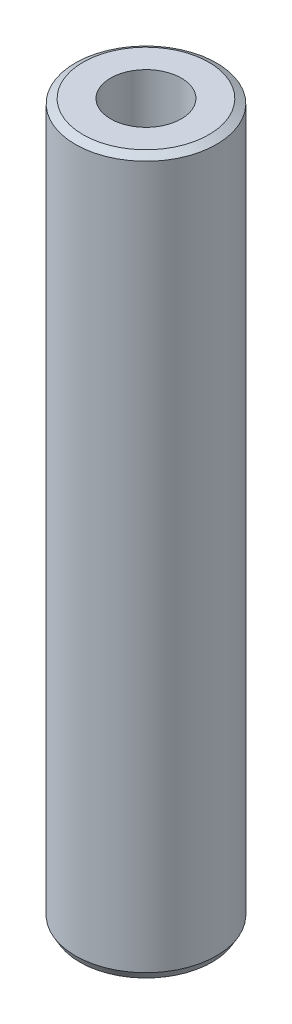
ISO-10303-21;
HEADER;
FILE_DESCRIPTION(('STEP AP214'),'2;1');
FILE_NAME('part.step','',(''),(''),'','','');
FILE_SCHEMA(('AUTOMOTIVE_DESIGN { 1 0 10303 214 1 1 1 1 }'));
ENDSEC;
DATA;
#1=APPLICATION_CONTEXT('core data for automotive mechanical design processes');
#2=APPLICATION_PROTOCOL_DEFINITION('international standard','automotive_design',2000,#1);
#3=PRODUCT_CONTEXT('',#1,'mechanical');
#4=PRODUCT('Part','Part','',(#3));
#5=PRODUCT_RELATED_PRODUCT_CATEGORY('part','',(#4));
#6=PRODUCT_DEFINITION_FORMATION('','',#4);
#7=PRODUCT_DEFINITION_CONTEXT('part definition',#1,'design');
#8=PRODUCT_DEFINITION('design','',#6,#7);
#9=PRODUCT_DEFINITION_SHAPE('','',#8);
#10=(LENGTH_UNIT() NAMED_UNIT(*) SI_UNIT(.MILLI.,.METRE.));
#11=(NAMED_UNIT(*) PLANE_ANGLE_UNIT() SI_UNIT($,.RADIAN.));
#12=(NAMED_UNIT(*) SI_UNIT($,.STERADIAN.) SOLID_ANGLE_UNIT());
#13=UNCERTAINTY_MEASURE_WITH_UNIT(LENGTH_MEASURE(1.E-05),#10,'distance_accuracy_value','');
#14=(GEOMETRIC_REPRESENTATION_CONTEXT(3) GLOBAL_UNCERTAINTY_ASSIGNED_CONTEXT((#13)) GLOBAL_UNIT_ASSIGNED_CONTEXT((#10,
#11,#12)) REPRESENTATION_CONTEXT('',''));
#15=CARTESIAN_POINT('',(0.,0.,0.));
#16=DIRECTION('',(0.,0.,1.));
#17=DIRECTION('',(1.,0.,0.));
#18=AXIS2_PLACEMENT_3D('',#15,#16,#17);
#19=CARTESIAN_POINT('',(0.,556.911873486124,0.));
#20=DIRECTION('',(0.,-1.,0.));
#21=DIRECTION('',(0.,0.,-1.));
#22=AXIS2_PLACEMENT_3D('',#19,#20,#21);
#23=CYLINDRICAL_SURFACE('',#22,55.);
#24=CARTESIAN_POINT('',(0.,553.421854564124,0.));
#25=DIRECTION('',(0.,1.,0.));
#26=DIRECTION('',(0.,0.,1.));
#27=AXIS2_PLACEMENT_3D('',#24,#25,#26);
#28=CIRCLE('',#27,55.);
#29=CARTESIAN_POINT('',(0.,553.421854564124,55.));
#30=VERTEX_POINT('',#29);
#31=EDGE_CURVE('E50',#30,#30,#28,.F.);
#32=ORIENTED_EDGE('',*,*,#31,.T.);
#33=EDGE_LOOP('',(#32));
#34=FACE_BOUND('',#33,.T.);
#35=CARTESIAN_POINT('',(0.,6.0448900922806,0.));
#36=DIRECTION('',(0.,1.,0.));
#37=DIRECTION('',(0.,0.,1.));
#38=AXIS2_PLACEMENT_3D('',#35,#36,#37);
#39=CIRCLE('',#38,55.);
#40=CARTESIAN_POINT('',(0.,6.0448900922806,55.));
#41=VERTEX_POINT('',#40);
#42=EDGE_CURVE('E51',#41,#41,#39,.T.);
#43=ORIENTED_EDGE('',*,*,#42,.T.);
#44=EDGE_LOOP('',(#43));
#45=FACE_BOUND('',#44,.T.);
#46=ADVANCED_FACE('F39',(#34,#45),#23,.T.);
#47=CARTESIAN_POINT('',(0.,556.911873486124,0.));
#48=DIRECTION('',(0.,1.,0.));
#49=DIRECTION('',(0.,0.,1.));
#50=AXIS2_PLACEMENT_3D('',#47,#48,#49);
#51=PLANE('',#50);
#52=CARTESIAN_POINT('',(0.,556.911873486124,0.));
#53=DIRECTION('',(0.,1.,0.));
#54=DIRECTION('',(0.,0.,1.));
#55=AXIS2_PLACEMENT_3D('',#52,#53,#54);
#56=CIRCLE('',#55,48.9551099077193);
#57=CARTESIAN_POINT('',(0.,556.911873486124,48.9551099077193));
#58=VERTEX_POINT('',#57);
#59=EDGE_CURVE('E54',#58,#58,#56,.T.);
#60=ORIENTED_EDGE('',*,*,#59,.T.);
#61=EDGE_LOOP('',(#60));
#62=FACE_BOUND('',#61,.T.);
#63=CARTESIAN_POINT('',(0.,556.911873486124,0.));
#64=DIRECTION('',(0.,1.,0.));
#65=DIRECTION('',(0.,0.,1.));
#66=AXIS2_PLACEMENT_3D('',#63,#64,#65);
#67=CIRCLE('',#66,27.5492454448073);
#68=CARTESIAN_POINT('',(0.,556.911873486124,27.5492454448073));
#69=VERTEX_POINT('',#68);
#70=EDGE_CURVE('E58',#69,#69,#67,.T.);
#71=ORIENTED_EDGE('',*,*,#70,.F.);
#72=EDGE_LOOP('',(#71));
#73=FACE_BOUND('',#72,.T.);
#74=ADVANCED_FACE('F69',(#62,#73),#51,.T.);
#75=CARTESIAN_POINT('',(0.,0.,0.));
#76=DIRECTION('',(0.,1.,0.));
#77=DIRECTION('',(0.,0.,1.));
#78=AXIS2_PLACEMENT_3D('',#75,#76,#77);
#79=PLANE('',#78);
#80=CARTESIAN_POINT('',(0.,0.,0.));
#81=DIRECTION('',(0.,1.,0.));
#82=DIRECTION('',(0.,0.,1.));
#83=AXIS2_PLACEMENT_3D('',#80,#81,#82);
#84=CIRCLE('',#83,51.5099810780001);
#85=CARTESIAN_POINT('',(0.,0.,51.5099810780001));
#86=VERTEX_POINT('',#85);
#87=EDGE_CURVE('E10',#86,#86,#84,.F.);
#88=ORIENTED_EDGE('',*,*,#87,.T.);
#89=EDGE_LOOP('',(#88));
#90=FACE_BOUND('',#89,.T.);
#91=CARTESIAN_POINT('',(0.,0.,0.));
#92=DIRECTION('',(0.,1.,0.));
#93=DIRECTION('',(0.,0.,1.));
#94=AXIS2_PLACEMENT_3D('',#91,#92,#93);
#95=CIRCLE('',#94,27.5492454448073);
#96=CARTESIAN_POINT('',(0.,0.,27.5492454448073));
#97=VERTEX_POINT('',#96);
#98=EDGE_CURVE('E63',#97,#97,#95,.T.);
#99=ORIENTED_EDGE('',*,*,#98,.T.);
#100=EDGE_LOOP('',(#99));
#101=FACE_BOUND('',#100,.T.);
#102=ADVANCED_FACE('F75',(#90,#101),#79,.F.);
#103=CARTESIAN_POINT('',(0.,556.911873486124,0.));
#104=DIRECTION('',(0.,-1.,0.));
#105=DIRECTION('',(0.,0.,-1.));
#106=AXIS2_PLACEMENT_3D('',#103,#104,#105);
#107=CYLINDRICAL_SURFACE('',#106,27.5492454448073);
#108=ORIENTED_EDGE('',*,*,#70,.T.);
#109=EDGE_LOOP('',(#108));
#110=FACE_BOUND('',#109,.T.);
#111=ORIENTED_EDGE('',*,*,#98,.F.);
#112=EDGE_LOOP('',(#111));
#113=FACE_BOUND('',#112,.T.);
#114=ADVANCED_FACE('F70',(#110,#113),#107,.F.);
#115=CARTESIAN_POINT('',(0.,556.911873486124,0.));
#116=DIRECTION('',(0.,-1.,0.));
#117=DIRECTION('',(0.,0.,-1.));
#118=AXIS2_PLACEMENT_3D('',#115,#116,#117);
#119=CONICAL_SURFACE('',#118,48.9551099077193,1.0471975511966);
#120=ORIENTED_EDGE('',*,*,#31,.F.);
#121=EDGE_LOOP('',(#120));
#122=FACE_BOUND('',#121,.T.);
#123=ORIENTED_EDGE('',*,*,#59,.F.);
#124=EDGE_LOOP('',(#123));
#125=FACE_BOUND('',#124,.T.);
#126=ADVANCED_FACE('F81',(#122,#125),#119,.T.);
#127=CARTESIAN_POINT('',(0.,6.0448900922806,0.));
#128=DIRECTION('',(0.,1.,0.));
#129=DIRECTION('',(0.,0.,1.));
#130=AXIS2_PLACEMENT_3D('',#127,#128,#129);
#131=CONICAL_SURFACE('',#130,55.,0.523598775598303);
#132=ORIENTED_EDGE('',*,*,#87,.F.);
#133=EDGE_LOOP('',(#132));
#134=FACE_BOUND('',#133,.T.);
#135=ORIENTED_EDGE('',*,*,#42,.F.);
#136=EDGE_LOOP('',(#135));
#137=FACE_BOUND('',#136,.T.);
#138=ADVANCED_FACE('F45',(#134,#137),#131,.T.);
#139=CLOSED_SHELL('',(#46,#74,#102,#114,#126,#138));
#140=MANIFOLD_SOLID_BREP('B2',#139);
#141=ADVANCED_BREP_SHAPE_REPRESENTATION('',(#18,#140),#14);
#142=SHAPE_DEFINITION_REPRESENTATION(#9,#141);
ENDSEC;
END-ISO-10303-21;
